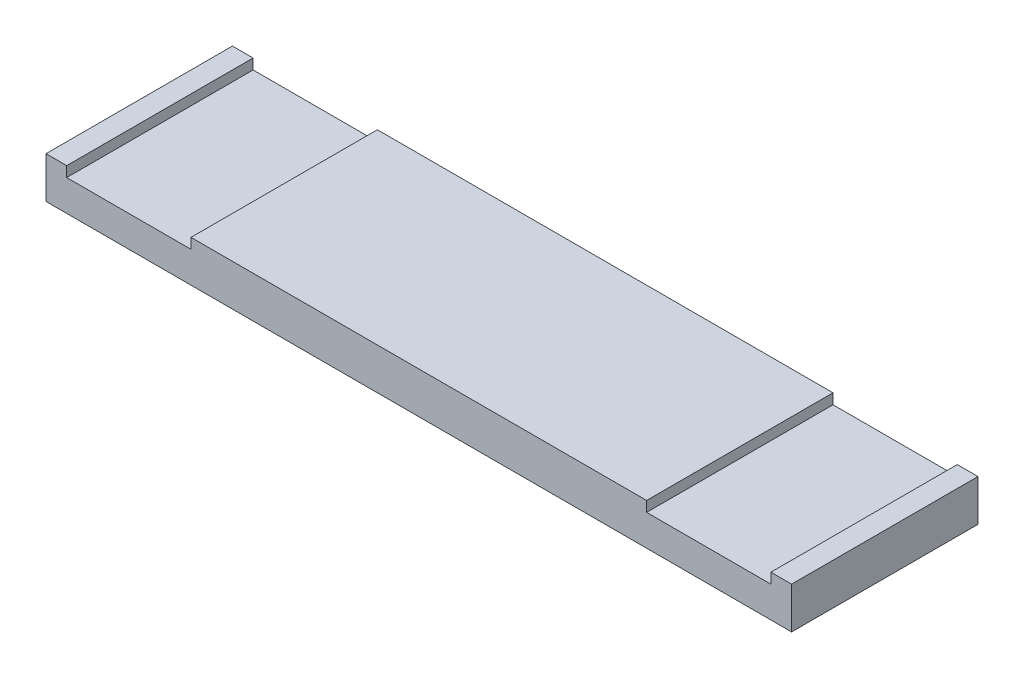
ISO-10303-21;
HEADER;
FILE_DESCRIPTION(('STEP AP214'),'2;1');
FILE_NAME('part.step','',(''),(''),'','','');
FILE_SCHEMA(('AUTOMOTIVE_DESIGN { 1 0 10303 214 1 1 1 1 }'));
ENDSEC;
DATA;
#1=APPLICATION_CONTEXT('core data for automotive mechanical design processes');
#2=APPLICATION_PROTOCOL_DEFINITION('international standard','automotive_design',2000,#1);
#3=PRODUCT_CONTEXT('',#1,'mechanical');
#4=PRODUCT('Part','Part','',(#3));
#5=PRODUCT_RELATED_PRODUCT_CATEGORY('part','',(#4));
#6=PRODUCT_DEFINITION_FORMATION('','',#4);
#7=PRODUCT_DEFINITION_CONTEXT('part definition',#1,'design');
#8=PRODUCT_DEFINITION('design','',#6,#7);
#9=PRODUCT_DEFINITION_SHAPE('','',#8);
#10=(LENGTH_UNIT() NAMED_UNIT(*) SI_UNIT(.MILLI.,.METRE.));
#11=(NAMED_UNIT(*) PLANE_ANGLE_UNIT() SI_UNIT($,.RADIAN.));
#12=(NAMED_UNIT(*) SI_UNIT($,.STERADIAN.) SOLID_ANGLE_UNIT());
#13=UNCERTAINTY_MEASURE_WITH_UNIT(LENGTH_MEASURE(1.E-05),#10,'distance_accuracy_value','');
#14=(GEOMETRIC_REPRESENTATION_CONTEXT(3) GLOBAL_UNCERTAINTY_ASSIGNED_CONTEXT((#13)) GLOBAL_UNIT_ASSIGNED_CONTEXT((#10,
#11,#12)) REPRESENTATION_CONTEXT('',''));
#15=CARTESIAN_POINT('',(0.,0.,0.));
#16=DIRECTION('',(0.,0.,1.));
#17=DIRECTION('',(1.,0.,0.));
#18=AXIS2_PLACEMENT_3D('',#15,#16,#17);
#19=CARTESIAN_POINT('',(0.,0.,0.));
#20=DIRECTION('',(0.,1.,0.));
#21=DIRECTION('',(1.,0.,0.));
#22=AXIS2_PLACEMENT_3D('',#19,#20,#21);
#23=PLANE('',#22);
#24=DIRECTION('',(0.,0.,1.));
#25=VECTOR('',#24,1.);
#26=CARTESIAN_POINT('',(0.,0.,-228.6));
#27=LINE('',#26,#25);
#28=CARTESIAN_POINT('',(0.,0.,-228.6));
#29=VERTEX_POINT('',#28);
#30=CARTESIAN_POINT('',(0.,0.,0.));
#31=VERTEX_POINT('',#30);
#32=EDGE_CURVE('E27',#29,#31,#27,.T.);
#33=ORIENTED_EDGE('',*,*,#32,.F.);
#34=DIRECTION('',(-1.,0.,0.));
#35=VECTOR('',#34,1.);
#36=CARTESIAN_POINT('',(914.4,0.,-228.6));
#37=LINE('',#36,#35);
#38=CARTESIAN_POINT('',(914.4,0.,-228.6));
#39=VERTEX_POINT('',#38);
#40=EDGE_CURVE('E36',#39,#29,#37,.T.);
#41=ORIENTED_EDGE('',*,*,#40,.F.);
#42=DIRECTION('',(0.,0.,-1.));
#43=VECTOR('',#42,1.);
#44=CARTESIAN_POINT('',(914.4,0.,0.));
#45=LINE('',#44,#43);
#46=CARTESIAN_POINT('',(914.4,0.,0.));
#47=VERTEX_POINT('',#46);
#48=EDGE_CURVE('E165',#47,#39,#45,.T.);
#49=ORIENTED_EDGE('',*,*,#48,.F.);
#50=DIRECTION('',(1.,0.,0.));
#51=VECTOR('',#50,1.);
#52=CARTESIAN_POINT('',(0.,0.,0.));
#53=LINE('',#52,#51);
#54=EDGE_CURVE('E122',#31,#47,#53,.T.);
#55=ORIENTED_EDGE('',*,*,#54,.F.);
#56=EDGE_LOOP('',(#33,#41,#49,#55));
#57=FACE_BOUND('',#56,.T.);
#58=ADVANCED_FACE('F16',(#57),#23,.F.);
#59=CARTESIAN_POINT('',(0.,0.,-228.6));
#60=DIRECTION('',(-1.,0.,0.));
#61=DIRECTION('',(0.,0.,1.));
#62=AXIS2_PLACEMENT_3D('',#59,#60,#61);
#63=PLANE('',#62);
#64=DIRECTION('',(0.,1.,0.));
#65=VECTOR('',#64,1.);
#66=CARTESIAN_POINT('',(0.,0.,0.));
#67=LINE('',#66,#65);
#68=CARTESIAN_POINT('',(0.,50.8,0.));
#69=VERTEX_POINT('',#68);
#70=EDGE_CURVE('E10',#31,#69,#67,.T.);
#71=ORIENTED_EDGE('',*,*,#70,.T.);
#72=DIRECTION('',(0.,0.,1.));
#73=VECTOR('',#72,1.);
#74=CARTESIAN_POINT('',(0.,50.8,-228.6));
#75=LINE('',#74,#73);
#76=CARTESIAN_POINT('',(0.,50.8,-228.6));
#77=VERTEX_POINT('',#76);
#78=EDGE_CURVE('E221',#77,#69,#75,.T.);
#79=ORIENTED_EDGE('',*,*,#78,.F.);
#80=DIRECTION('',(0.,1.,0.));
#81=VECTOR('',#80,1.);
#82=CARTESIAN_POINT('',(0.,0.,-228.6));
#83=LINE('',#82,#81);
#84=EDGE_CURVE('E147',#29,#77,#83,.T.);
#85=ORIENTED_EDGE('',*,*,#84,.F.);
#86=ORIENTED_EDGE('',*,*,#32,.T.);
#87=EDGE_LOOP('',(#71,#79,#85,#86));
#88=FACE_BOUND('',#87,.T.);
#89=ADVANCED_FACE('F242',(#88),#63,.T.);
#90=CARTESIAN_POINT('',(914.4,0.,-228.6));
#91=DIRECTION('',(0.,0.,-1.));
#92=DIRECTION('',(-1.,0.,0.));
#93=AXIS2_PLACEMENT_3D('',#90,#91,#92);
#94=PLANE('',#93);
#95=DIRECTION('',(0.,-1.,0.));
#96=VECTOR('',#95,1.);
#97=CARTESIAN_POINT('',(177.8,50.8,-228.6));
#98=LINE('',#97,#96);
#99=CARTESIAN_POINT('',(177.8,50.8,-228.6));
#100=VERTEX_POINT('',#99);
#101=CARTESIAN_POINT('',(177.8,38.1,-228.6));
#102=VERTEX_POINT('',#101);
#103=EDGE_CURVE('E205',#100,#102,#98,.T.);
#104=ORIENTED_EDGE('',*,*,#103,.F.);
#105=DIRECTION('',(-1.,0.,0.));
#106=VECTOR('',#105,1.);
#107=CARTESIAN_POINT('',(736.6,50.8,-228.6));
#108=LINE('',#107,#106);
#109=CARTESIAN_POINT('',(736.6,50.8,-228.6));
#110=VERTEX_POINT('',#109);
#111=EDGE_CURVE('E159',#110,#100,#108,.T.);
#112=ORIENTED_EDGE('',*,*,#111,.F.);
#113=DIRECTION('',(0.,-1.,0.));
#114=VECTOR('',#113,1.);
#115=CARTESIAN_POINT('',(736.6,50.8,-228.6));
#116=LINE('',#115,#114);
#117=CARTESIAN_POINT('',(736.6,38.1,-228.6));
#118=VERTEX_POINT('',#117);
#119=EDGE_CURVE('E161',#110,#118,#116,.T.);
#120=ORIENTED_EDGE('',*,*,#119,.T.);
#121=DIRECTION('',(1.,0.,0.));
#122=VECTOR('',#121,1.);
#123=CARTESIAN_POINT('',(736.6,38.1,-228.6));
#124=LINE('',#123,#122);
#125=CARTESIAN_POINT('',(889.,38.1,-228.6));
#126=VERTEX_POINT('',#125);
#127=EDGE_CURVE('E142',#118,#126,#124,.T.);
#128=ORIENTED_EDGE('',*,*,#127,.T.);
#129=DIRECTION('',(0.,-1.,0.));
#130=VECTOR('',#129,1.);
#131=CARTESIAN_POINT('',(889.,50.8,-228.6));
#132=LINE('',#131,#130);
#133=CARTESIAN_POINT('',(889.,50.8,-228.6));
#134=VERTEX_POINT('',#133);
#135=EDGE_CURVE('E138',#134,#126,#132,.T.);
#136=ORIENTED_EDGE('',*,*,#135,.F.);
#137=DIRECTION('',(-1.,0.,0.));
#138=VECTOR('',#137,1.);
#139=CARTESIAN_POINT('',(914.4,50.8,-228.6));
#140=LINE('',#139,#138);
#141=CARTESIAN_POINT('',(914.4,50.8,-228.6));
#142=VERTEX_POINT('',#141);
#143=EDGE_CURVE('E115',#142,#134,#140,.T.);
#144=ORIENTED_EDGE('',*,*,#143,.F.);
#145=DIRECTION('',(0.,1.,0.));
#146=VECTOR('',#145,1.);
#147=CARTESIAN_POINT('',(914.4,0.,-228.6));
#148=LINE('',#147,#146);
#149=EDGE_CURVE('E110',#39,#142,#148,.T.);
#150=ORIENTED_EDGE('',*,*,#149,.F.);
#151=ORIENTED_EDGE('',*,*,#40,.T.);
#152=ORIENTED_EDGE('',*,*,#84,.T.);
#153=DIRECTION('',(-1.,0.,0.));
#154=VECTOR('',#153,1.);
#155=CARTESIAN_POINT('',(25.4,50.8,-228.6));
#156=LINE('',#155,#154);
#157=CARTESIAN_POINT('',(25.4,50.8,-228.6));
#158=VERTEX_POINT('',#157);
#159=EDGE_CURVE('E192',#158,#77,#156,.T.);
#160=ORIENTED_EDGE('',*,*,#159,.F.);
#161=DIRECTION('',(0.,-1.,0.));
#162=VECTOR('',#161,1.);
#163=CARTESIAN_POINT('',(25.4,50.8,-228.6));
#164=LINE('',#163,#162);
#165=CARTESIAN_POINT('',(25.4,38.1,-228.6));
#166=VERTEX_POINT('',#165);
#167=EDGE_CURVE('E144',#158,#166,#164,.T.);
#168=ORIENTED_EDGE('',*,*,#167,.T.);
#169=DIRECTION('',(1.,0.,0.));
#170=VECTOR('',#169,1.);
#171=CARTESIAN_POINT('',(25.4,38.1,-228.6));
#172=LINE('',#171,#170);
#173=EDGE_CURVE('E148',#166,#102,#172,.T.);
#174=ORIENTED_EDGE('',*,*,#173,.T.);
#175=EDGE_LOOP('',(#104,#112,#120,#128,#136,#144,#150,#151,#152,#160,#168,#174));
#176=FACE_BOUND('',#175,.T.);
#177=ADVANCED_FACE('F259',(#176),#94,.T.);
#178=CARTESIAN_POINT('',(914.4,0.,0.));
#179=DIRECTION('',(1.,0.,0.));
#180=DIRECTION('',(0.,0.,-1.));
#181=AXIS2_PLACEMENT_3D('',#178,#179,#180);
#182=PLANE('',#181);
#183=ORIENTED_EDGE('',*,*,#149,.T.);
#184=DIRECTION('',(0.,0.,-1.));
#185=VECTOR('',#184,1.);
#186=CARTESIAN_POINT('',(914.4,50.8,0.));
#187=LINE('',#186,#185);
#188=CARTESIAN_POINT('',(914.4,50.8,0.));
#189=VERTEX_POINT('',#188);
#190=EDGE_CURVE('E106',#189,#142,#187,.T.);
#191=ORIENTED_EDGE('',*,*,#190,.F.);
#192=DIRECTION('',(0.,1.,0.));
#193=VECTOR('',#192,1.);
#194=CARTESIAN_POINT('',(914.4,0.,0.));
#195=LINE('',#194,#193);
#196=EDGE_CURVE('E109',#47,#189,#195,.T.);
#197=ORIENTED_EDGE('',*,*,#196,.F.);
#198=ORIENTED_EDGE('',*,*,#48,.T.);
#199=EDGE_LOOP('',(#183,#191,#197,#198));
#200=FACE_BOUND('',#199,.T.);
#201=ADVANCED_FACE('F108',(#200),#182,.T.);
#202=CARTESIAN_POINT('',(0.,0.,0.));
#203=DIRECTION('',(0.,0.,1.));
#204=DIRECTION('',(1.,0.,0.));
#205=AXIS2_PLACEMENT_3D('',#202,#203,#204);
#206=PLANE('',#205);
#207=DIRECTION('',(0.,-1.,0.));
#208=VECTOR('',#207,1.);
#209=CARTESIAN_POINT('',(25.4,50.8,0.));
#210=LINE('',#209,#208);
#211=CARTESIAN_POINT('',(25.4,50.8,0.));
#212=VERTEX_POINT('',#211);
#213=CARTESIAN_POINT('',(25.4,38.1,0.));
#214=VERTEX_POINT('',#213);
#215=EDGE_CURVE('E211',#212,#214,#210,.T.);
#216=ORIENTED_EDGE('',*,*,#215,.F.);
#217=DIRECTION('',(1.,0.,0.));
#218=VECTOR('',#217,1.);
#219=CARTESIAN_POINT('',(0.,50.8,0.));
#220=LINE('',#219,#218);
#221=EDGE_CURVE('E223',#69,#212,#220,.T.);
#222=ORIENTED_EDGE('',*,*,#221,.F.);
#223=ORIENTED_EDGE('',*,*,#70,.F.);
#224=ORIENTED_EDGE('',*,*,#54,.T.);
#225=ORIENTED_EDGE('',*,*,#196,.T.);
#226=DIRECTION('',(1.,0.,0.));
#227=VECTOR('',#226,1.);
#228=CARTESIAN_POINT('',(889.,50.8,0.));
#229=LINE('',#228,#227);
#230=CARTESIAN_POINT('',(889.,50.8,0.));
#231=VERTEX_POINT('',#230);
#232=EDGE_CURVE('E114',#231,#189,#229,.T.);
#233=ORIENTED_EDGE('',*,*,#232,.F.);
#234=DIRECTION('',(0.,-1.,0.));
#235=VECTOR('',#234,1.);
#236=CARTESIAN_POINT('',(889.,50.8,0.));
#237=LINE('',#236,#235);
#238=CARTESIAN_POINT('',(889.,38.1,0.));
#239=VERTEX_POINT('',#238);
#240=EDGE_CURVE('E125',#231,#239,#237,.T.);
#241=ORIENTED_EDGE('',*,*,#240,.T.);
#242=DIRECTION('',(1.,0.,0.));
#243=VECTOR('',#242,1.);
#244=CARTESIAN_POINT('',(736.6,38.1,0.));
#245=LINE('',#244,#243);
#246=CARTESIAN_POINT('',(736.6,38.1,0.));
#247=VERTEX_POINT('',#246);
#248=EDGE_CURVE('E153',#247,#239,#245,.T.);
#249=ORIENTED_EDGE('',*,*,#248,.F.);
#250=DIRECTION('',(0.,-1.,0.));
#251=VECTOR('',#250,1.);
#252=CARTESIAN_POINT('',(736.6,50.8,0.));
#253=LINE('',#252,#251);
#254=CARTESIAN_POINT('',(736.6,50.8,0.));
#255=VERTEX_POINT('',#254);
#256=EDGE_CURVE('E20',#255,#247,#253,.T.);
#257=ORIENTED_EDGE('',*,*,#256,.F.);
#258=DIRECTION('',(1.,0.,0.));
#259=VECTOR('',#258,1.);
#260=CARTESIAN_POINT('',(177.8,50.8,0.));
#261=LINE('',#260,#259);
#262=CARTESIAN_POINT('',(177.8,50.8,0.));
#263=VERTEX_POINT('',#262);
#264=EDGE_CURVE('E155',#263,#255,#261,.T.);
#265=ORIENTED_EDGE('',*,*,#264,.F.);
#266=DIRECTION('',(0.,-1.,0.));
#267=VECTOR('',#266,1.);
#268=CARTESIAN_POINT('',(177.8,50.8,0.));
#269=LINE('',#268,#267);
#270=CARTESIAN_POINT('',(177.8,38.1,0.));
#271=VERTEX_POINT('',#270);
#272=EDGE_CURVE('E188',#263,#271,#269,.T.);
#273=ORIENTED_EDGE('',*,*,#272,.T.);
#274=DIRECTION('',(1.,0.,0.));
#275=VECTOR('',#274,1.);
#276=CARTESIAN_POINT('',(25.4,38.1,0.));
#277=LINE('',#276,#275);
#278=EDGE_CURVE('E185',#214,#271,#277,.T.);
#279=ORIENTED_EDGE('',*,*,#278,.F.);
#280=EDGE_LOOP('',(#216,#222,#223,#224,#225,#233,#241,#249,#257,#265,#273,#279));
#281=FACE_BOUND('',#280,.T.);
#282=ADVANCED_FACE('F118',(#281),#206,.T.);
#283=CARTESIAN_POINT('',(0.,50.8,0.));
#284=DIRECTION('',(0.,1.,0.));
#285=DIRECTION('',(1.,0.,0.));
#286=AXIS2_PLACEMENT_3D('',#283,#284,#285);
#287=PLANE('',#286);
#288=ORIENTED_EDGE('',*,*,#159,.T.);
#289=ORIENTED_EDGE('',*,*,#78,.T.);
#290=ORIENTED_EDGE('',*,*,#221,.T.);
#291=DIRECTION('',(0.,0.,1.));
#292=VECTOR('',#291,1.);
#293=CARTESIAN_POINT('',(25.4,50.8,-228.6));
#294=LINE('',#293,#292);
#295=EDGE_CURVE('E208',#158,#212,#294,.T.);
#296=ORIENTED_EDGE('',*,*,#295,.F.);
#297=EDGE_LOOP('',(#288,#289,#290,#296));
#298=FACE_BOUND('',#297,.T.);
#299=ADVANCED_FACE('F236',(#298),#287,.T.);
#300=CARTESIAN_POINT('',(177.8,50.8,0.));
#301=DIRECTION('',(1.,0.,0.));
#302=DIRECTION('',(0.,0.,-1.));
#303=AXIS2_PLACEMENT_3D('',#300,#301,#302);
#304=PLANE('',#303);
#305=ORIENTED_EDGE('',*,*,#103,.T.);
#306=DIRECTION('',(0.,0.,-1.));
#307=VECTOR('',#306,1.);
#308=CARTESIAN_POINT('',(177.8,38.1,0.));
#309=LINE('',#308,#307);
#310=EDGE_CURVE('E184',#271,#102,#309,.T.);
#311=ORIENTED_EDGE('',*,*,#310,.F.);
#312=ORIENTED_EDGE('',*,*,#272,.F.);
#313=DIRECTION('',(0.,0.,-1.));
#314=VECTOR('',#313,1.);
#315=CARTESIAN_POINT('',(177.8,50.8,0.));
#316=LINE('',#315,#314);
#317=EDGE_CURVE('E158',#263,#100,#316,.T.);
#318=ORIENTED_EDGE('',*,*,#317,.T.);
#319=EDGE_LOOP('',(#305,#311,#312,#318));
#320=FACE_BOUND('',#319,.T.);
#321=ADVANCED_FACE('F325',(#320),#304,.F.);
#322=CARTESIAN_POINT('',(0.,50.8,0.));
#323=DIRECTION('',(0.,1.,0.));
#324=DIRECTION('',(1.,0.,0.));
#325=AXIS2_PLACEMENT_3D('',#322,#323,#324);
#326=PLANE('',#325);
#327=ORIENTED_EDGE('',*,*,#264,.T.);
#328=DIRECTION('',(0.,0.,1.));
#329=VECTOR('',#328,1.);
#330=CARTESIAN_POINT('',(736.6,50.8,-228.6));
#331=LINE('',#330,#329);
#332=EDGE_CURVE('E195',#110,#255,#331,.T.);
#333=ORIENTED_EDGE('',*,*,#332,.F.);
#334=ORIENTED_EDGE('',*,*,#111,.T.);
#335=ORIENTED_EDGE('',*,*,#317,.F.);
#336=EDGE_LOOP('',(#327,#333,#334,#335));
#337=FACE_BOUND('',#336,.T.);
#338=ADVANCED_FACE('F349',(#337),#326,.T.);
#339=CARTESIAN_POINT('',(736.6,50.8,-228.6));
#340=DIRECTION('',(-1.,0.,0.));
#341=DIRECTION('',(0.,0.,1.));
#342=AXIS2_PLACEMENT_3D('',#339,#340,#341);
#343=PLANE('',#342);
#344=ORIENTED_EDGE('',*,*,#256,.T.);
#345=DIRECTION('',(0.,0.,1.));
#346=VECTOR('',#345,1.);
#347=CARTESIAN_POINT('',(736.6,38.1,-228.6));
#348=LINE('',#347,#346);
#349=EDGE_CURVE('E149',#118,#247,#348,.T.);
#350=ORIENTED_EDGE('',*,*,#349,.F.);
#351=ORIENTED_EDGE('',*,*,#119,.F.);
#352=ORIENTED_EDGE('',*,*,#332,.T.);
#353=EDGE_LOOP('',(#344,#350,#351,#352));
#354=FACE_BOUND('',#353,.T.);
#355=ADVANCED_FACE('F269',(#354),#343,.F.);
#356=CARTESIAN_POINT('',(0.,38.1,0.));
#357=DIRECTION('',(0.,1.,0.));
#358=DIRECTION('',(1.,0.,0.));
#359=AXIS2_PLACEMENT_3D('',#356,#357,#358);
#360=PLANE('',#359);
#361=DIRECTION('',(0.,0.,-1.));
#362=VECTOR('',#361,1.);
#363=CARTESIAN_POINT('',(889.,38.1,0.));
#364=LINE('',#363,#362);
#365=EDGE_CURVE('E152',#239,#126,#364,.T.);
#366=ORIENTED_EDGE('',*,*,#365,.T.);
#367=ORIENTED_EDGE('',*,*,#127,.F.);
#368=ORIENTED_EDGE('',*,*,#349,.T.);
#369=ORIENTED_EDGE('',*,*,#248,.T.);
#370=EDGE_LOOP('',(#366,#367,#368,#369));
#371=FACE_BOUND('',#370,.T.);
#372=ADVANCED_FACE('F264',(#371),#360,.T.);
#373=CARTESIAN_POINT('',(889.,50.8,0.));
#374=DIRECTION('',(1.,0.,0.));
#375=DIRECTION('',(0.,0.,-1.));
#376=AXIS2_PLACEMENT_3D('',#373,#374,#375);
#377=PLANE('',#376);
#378=ORIENTED_EDGE('',*,*,#135,.T.);
#379=ORIENTED_EDGE('',*,*,#365,.F.);
#380=ORIENTED_EDGE('',*,*,#240,.F.);
#381=DIRECTION('',(0.,0.,-1.));
#382=VECTOR('',#381,1.);
#383=CARTESIAN_POINT('',(889.,50.8,0.));
#384=LINE('',#383,#382);
#385=EDGE_CURVE('E130',#231,#134,#384,.T.);
#386=ORIENTED_EDGE('',*,*,#385,.T.);
#387=EDGE_LOOP('',(#378,#379,#380,#386));
#388=FACE_BOUND('',#387,.T.);
#389=ADVANCED_FACE('F266',(#388),#377,.F.);
#390=CARTESIAN_POINT('',(0.,50.8,0.));
#391=DIRECTION('',(0.,1.,0.));
#392=DIRECTION('',(1.,0.,0.));
#393=AXIS2_PLACEMENT_3D('',#390,#391,#392);
#394=PLANE('',#393);
#395=ORIENTED_EDGE('',*,*,#232,.T.);
#396=ORIENTED_EDGE('',*,*,#190,.T.);
#397=ORIENTED_EDGE('',*,*,#143,.T.);
#398=ORIENTED_EDGE('',*,*,#385,.F.);
#399=EDGE_LOOP('',(#395,#396,#397,#398));
#400=FACE_BOUND('',#399,.T.);
#401=ADVANCED_FACE('F128',(#400),#394,.T.);
#402=CARTESIAN_POINT('',(25.4,50.8,-228.6));
#403=DIRECTION('',(-1.,0.,0.));
#404=DIRECTION('',(0.,0.,1.));
#405=AXIS2_PLACEMENT_3D('',#402,#403,#404);
#406=PLANE('',#405);
#407=ORIENTED_EDGE('',*,*,#215,.T.);
#408=DIRECTION('',(0.,0.,1.));
#409=VECTOR('',#408,1.);
#410=CARTESIAN_POINT('',(25.4,38.1,-228.6));
#411=LINE('',#410,#409);
#412=EDGE_CURVE('E181',#166,#214,#411,.T.);
#413=ORIENTED_EDGE('',*,*,#412,.F.);
#414=ORIENTED_EDGE('',*,*,#167,.F.);
#415=ORIENTED_EDGE('',*,*,#295,.T.);
#416=EDGE_LOOP('',(#407,#413,#414,#415));
#417=FACE_BOUND('',#416,.T.);
#418=ADVANCED_FACE('F18',(#417),#406,.F.);
#419=CARTESIAN_POINT('',(0.,38.1,0.));
#420=DIRECTION('',(0.,1.,0.));
#421=DIRECTION('',(1.,0.,0.));
#422=AXIS2_PLACEMENT_3D('',#419,#420,#421);
#423=PLANE('',#422);
#424=ORIENTED_EDGE('',*,*,#310,.T.);
#425=ORIENTED_EDGE('',*,*,#173,.F.);
#426=ORIENTED_EDGE('',*,*,#412,.T.);
#427=ORIENTED_EDGE('',*,*,#278,.T.);
#428=EDGE_LOOP('',(#424,#425,#426,#427));
#429=FACE_BOUND('',#428,.T.);
#430=ADVANCED_FACE('F273',(#429),#423,.T.);
#431=CLOSED_SHELL('',(#58,#89,#177,#201,#282,#299,#321,#338,#355,#372,#389,#401,#418,#430));
#432=MANIFOLD_SOLID_BREP('B1',#431);
#433=ADVANCED_BREP_SHAPE_REPRESENTATION('',(#18,#432),#14);
#434=SHAPE_DEFINITION_REPRESENTATION(#9,#433);
ENDSEC;
END-ISO-10303-21;
